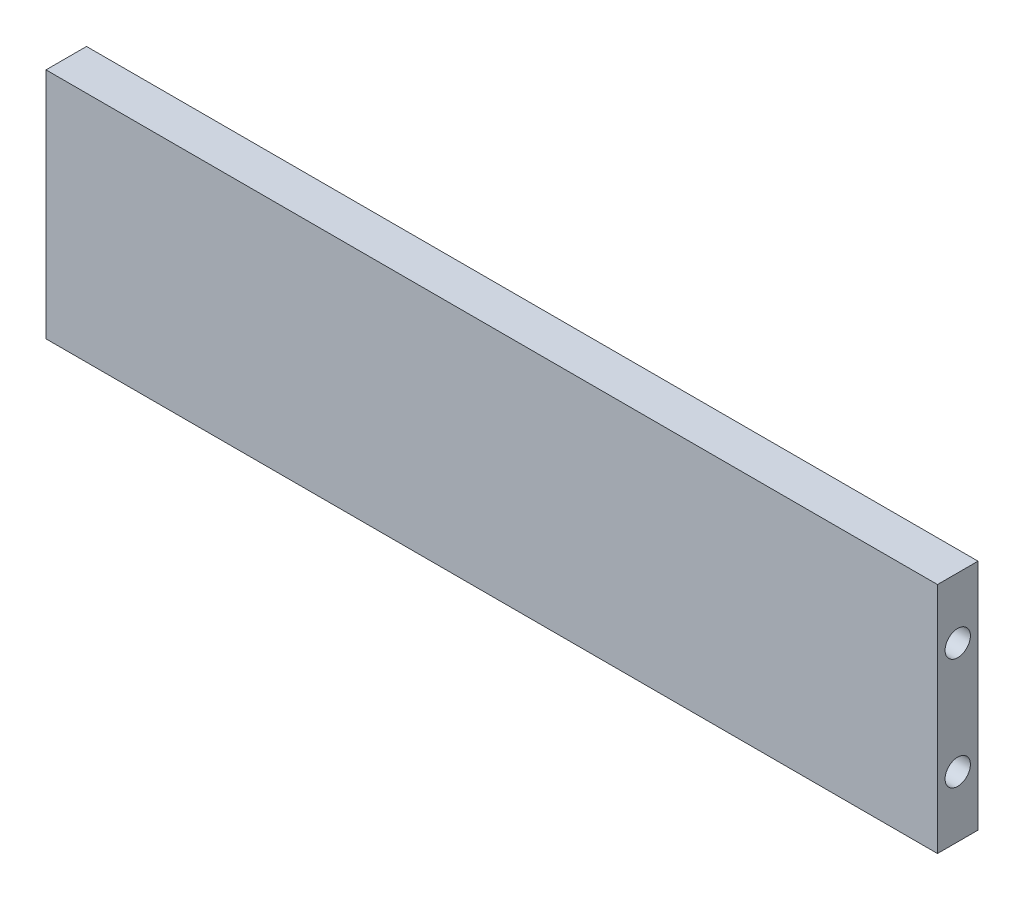
ISO-10303-21;
HEADER;
FILE_DESCRIPTION(('STEP AP214'),'2;1');
FILE_NAME('part.step','',(''),(''),'','','');
FILE_SCHEMA(('AUTOMOTIVE_DESIGN { 1 0 10303 214 1 1 1 1 }'));
ENDSEC;
DATA;
#1=APPLICATION_CONTEXT('core data for automotive mechanical design processes');
#2=APPLICATION_PROTOCOL_DEFINITION('international standard','automotive_design',2000,#1);
#3=PRODUCT_CONTEXT('',#1,'mechanical');
#4=PRODUCT('Part','Part','',(#3));
#5=PRODUCT_RELATED_PRODUCT_CATEGORY('part','',(#4));
#6=PRODUCT_DEFINITION_FORMATION('','',#4);
#7=PRODUCT_DEFINITION_CONTEXT('part definition',#1,'design');
#8=PRODUCT_DEFINITION('design','',#6,#7);
#9=PRODUCT_DEFINITION_SHAPE('','',#8);
#10=(LENGTH_UNIT() NAMED_UNIT(*) SI_UNIT(.MILLI.,.METRE.));
#11=(NAMED_UNIT(*) PLANE_ANGLE_UNIT() SI_UNIT($,.RADIAN.));
#12=(NAMED_UNIT(*) SI_UNIT($,.STERADIAN.) SOLID_ANGLE_UNIT());
#13=UNCERTAINTY_MEASURE_WITH_UNIT(LENGTH_MEASURE(1.E-05),#10,'distance_accuracy_value','');
#14=(GEOMETRIC_REPRESENTATION_CONTEXT(3) GLOBAL_UNCERTAINTY_ASSIGNED_CONTEXT((#13)) GLOBAL_UNIT_ASSIGNED_CONTEXT((#10,
#11,#12)) REPRESENTATION_CONTEXT('',''));
#15=CARTESIAN_POINT('',(0.,0.,0.));
#16=DIRECTION('',(0.,0.,1.));
#17=DIRECTION('',(1.,0.,0.));
#18=AXIS2_PLACEMENT_3D('',#15,#16,#17);
#19=CARTESIAN_POINT('',(0.,0.,4.));
#20=DIRECTION('',(1.,0.,0.));
#21=DIRECTION('',(0.,1.,0.));
#22=AXIS2_PLACEMENT_3D('',#19,#20,#21);
#23=PLANE('',#22);
#24=CARTESIAN_POINT('',(0.,-6.,2.));
#25=DIRECTION('',(-1.,0.,0.));
#26=DIRECTION('',(0.,-1.,0.));
#27=AXIS2_PLACEMENT_3D('',#24,#25,#26);
#28=CIRCLE('',#27,1.25);
#29=CARTESIAN_POINT('',(0.,-7.25,2.));
#30=VERTEX_POINT('',#29);
#31=EDGE_CURVE('E121',#30,#30,#28,.T.);
#32=ORIENTED_EDGE('',*,*,#31,.F.);
#33=EDGE_LOOP('',(#32));
#34=FACE_BOUND('',#33,.T.);
#35=CARTESIAN_POINT('',(0.,-17.,2.));
#36=DIRECTION('',(-1.,0.,0.));
#37=DIRECTION('',(0.,-1.,0.));
#38=AXIS2_PLACEMENT_3D('',#35,#36,#37);
#39=CIRCLE('',#38,1.25);
#40=CARTESIAN_POINT('',(0.,-18.25,2.));
#41=VERTEX_POINT('',#40);
#42=EDGE_CURVE('E114',#41,#41,#39,.T.);
#43=ORIENTED_EDGE('',*,*,#42,.F.);
#44=EDGE_LOOP('',(#43));
#45=FACE_BOUND('',#44,.T.);
#46=DIRECTION('',(0.,-1.,0.));
#47=VECTOR('',#46,1.);
#48=CARTESIAN_POINT('',(0.,0.,0.));
#49=LINE('',#48,#47);
#50=CARTESIAN_POINT('',(0.,0.,0.));
#51=VERTEX_POINT('',#50);
#52=CARTESIAN_POINT('',(0.,-23.,0.));
#53=VERTEX_POINT('',#52);
#54=EDGE_CURVE('E100',#51,#53,#49,.T.);
#55=ORIENTED_EDGE('',*,*,#54,.T.);
#56=DIRECTION('',(0.,0.,-1.));
#57=VECTOR('',#56,1.);
#58=CARTESIAN_POINT('',(0.,-23.,4.));
#59=LINE('',#58,#57);
#60=CARTESIAN_POINT('',(0.,-23.,4.));
#61=VERTEX_POINT('',#60);
#62=EDGE_CURVE('E11',#61,#53,#59,.T.);
#63=ORIENTED_EDGE('',*,*,#62,.F.);
#64=DIRECTION('',(0.,-1.,0.));
#65=VECTOR('',#64,1.);
#66=CARTESIAN_POINT('',(0.,0.,4.));
#67=LINE('',#66,#65);
#68=CARTESIAN_POINT('',(0.,0.,4.));
#69=VERTEX_POINT('',#68);
#70=EDGE_CURVE('E88',#69,#61,#67,.T.);
#71=ORIENTED_EDGE('',*,*,#70,.F.);
#72=DIRECTION('',(0.,0.,-1.));
#73=VECTOR('',#72,1.);
#74=CARTESIAN_POINT('',(0.,0.,4.));
#75=LINE('',#74,#73);
#76=EDGE_CURVE('E96',#69,#51,#75,.T.);
#77=ORIENTED_EDGE('',*,*,#76,.T.);
#78=EDGE_LOOP('',(#55,#63,#71,#77));
#79=FACE_BOUND('',#78,.T.);
#80=ADVANCED_FACE('F37',(#34,#45,#79),#23,.F.);
#81=CARTESIAN_POINT('',(0.,-23.,4.));
#82=DIRECTION('',(0.,1.,0.));
#83=DIRECTION('',(0.,0.,1.));
#84=AXIS2_PLACEMENT_3D('',#81,#82,#83);
#85=PLANE('',#84);
#86=DIRECTION('',(1.,0.,0.));
#87=VECTOR('',#86,1.);
#88=CARTESIAN_POINT('',(0.,-23.,0.));
#89=LINE('',#88,#87);
#90=CARTESIAN_POINT('',(88.01,-23.,0.));
#91=VERTEX_POINT('',#90);
#92=EDGE_CURVE('E92',#53,#91,#89,.T.);
#93=ORIENTED_EDGE('',*,*,#92,.T.);
#94=DIRECTION('',(0.,0.,-1.));
#95=VECTOR('',#94,1.);
#96=CARTESIAN_POINT('',(88.01,-23.,4.));
#97=LINE('',#96,#95);
#98=CARTESIAN_POINT('',(88.01,-23.,4.));
#99=VERTEX_POINT('',#98);
#100=EDGE_CURVE('E45',#99,#91,#97,.T.);
#101=ORIENTED_EDGE('',*,*,#100,.F.);
#102=DIRECTION('',(1.,0.,0.));
#103=VECTOR('',#102,1.);
#104=CARTESIAN_POINT('',(0.,-23.,4.));
#105=LINE('',#104,#103);
#106=EDGE_CURVE('E83',#61,#99,#105,.T.);
#107=ORIENTED_EDGE('',*,*,#106,.F.);
#108=ORIENTED_EDGE('',*,*,#62,.T.);
#109=EDGE_LOOP('',(#93,#101,#107,#108));
#110=FACE_BOUND('',#109,.T.);
#111=ADVANCED_FACE('F91',(#110),#85,.F.);
#112=CARTESIAN_POINT('',(88.01,0.,4.));
#113=DIRECTION('',(-1.,0.,0.));
#114=DIRECTION('',(0.,0.,1.));
#115=AXIS2_PLACEMENT_3D('',#112,#113,#114);
#116=PLANE('',#115);
#117=CARTESIAN_POINT('',(88.01,-6.,2.));
#118=DIRECTION('',(1.,0.,0.));
#119=DIRECTION('',(0.,0.,-1.));
#120=AXIS2_PLACEMENT_3D('',#117,#118,#119);
#121=CIRCLE('',#120,1.25);
#122=CARTESIAN_POINT('',(88.01,-6.,0.749999999999999));
#123=VERTEX_POINT('',#122);
#124=EDGE_CURVE('E132',#123,#123,#121,.T.);
#125=ORIENTED_EDGE('',*,*,#124,.F.);
#126=EDGE_LOOP('',(#125));
#127=FACE_BOUND('',#126,.T.);
#128=CARTESIAN_POINT('',(88.01,-17.,2.));
#129=DIRECTION('',(1.,0.,0.));
#130=DIRECTION('',(0.,0.,-1.));
#131=AXIS2_PLACEMENT_3D('',#128,#129,#130);
#132=CIRCLE('',#131,1.25);
#133=CARTESIAN_POINT('',(88.01,-17.,0.749999999999997));
#134=VERTEX_POINT('',#133);
#135=EDGE_CURVE('E126',#134,#134,#132,.T.);
#136=ORIENTED_EDGE('',*,*,#135,.F.);
#137=EDGE_LOOP('',(#136));
#138=FACE_BOUND('',#137,.T.);
#139=DIRECTION('',(0.,1.,0.));
#140=VECTOR('',#139,1.);
#141=CARTESIAN_POINT('',(88.01,0.,0.));
#142=LINE('',#141,#140);
#143=CARTESIAN_POINT('',(88.01,0.,0.));
#144=VERTEX_POINT('',#143);
#145=EDGE_CURVE('E70',#91,#144,#142,.T.);
#146=ORIENTED_EDGE('',*,*,#145,.T.);
#147=DIRECTION('',(0.,0.,-1.));
#148=VECTOR('',#147,1.);
#149=CARTESIAN_POINT('',(88.01,0.,4.));
#150=LINE('',#149,#148);
#151=CARTESIAN_POINT('',(88.01,0.,4.));
#152=VERTEX_POINT('',#151);
#153=EDGE_CURVE('E93',#152,#144,#150,.T.);
#154=ORIENTED_EDGE('',*,*,#153,.F.);
#155=DIRECTION('',(0.,1.,0.));
#156=VECTOR('',#155,1.);
#157=CARTESIAN_POINT('',(88.01,0.,4.));
#158=LINE('',#157,#156);
#159=EDGE_CURVE('E86',#99,#152,#158,.T.);
#160=ORIENTED_EDGE('',*,*,#159,.F.);
#161=ORIENTED_EDGE('',*,*,#100,.T.);
#162=EDGE_LOOP('',(#146,#154,#160,#161));
#163=FACE_BOUND('',#162,.T.);
#164=ADVANCED_FACE('F94',(#127,#138,#163),#116,.F.);
#165=CARTESIAN_POINT('',(0.,0.,4.));
#166=DIRECTION('',(0.,-1.,0.));
#167=DIRECTION('',(0.,0.,-1.));
#168=AXIS2_PLACEMENT_3D('',#165,#166,#167);
#169=PLANE('',#168);
#170=DIRECTION('',(-1.,0.,0.));
#171=VECTOR('',#170,1.);
#172=CARTESIAN_POINT('',(0.,0.,0.));
#173=LINE('',#172,#171);
#174=EDGE_CURVE('E76',#144,#51,#173,.T.);
#175=ORIENTED_EDGE('',*,*,#174,.T.);
#176=ORIENTED_EDGE('',*,*,#76,.F.);
#177=DIRECTION('',(-1.,0.,0.));
#178=VECTOR('',#177,1.);
#179=CARTESIAN_POINT('',(0.,0.,4.));
#180=LINE('',#179,#178);
#181=EDGE_CURVE('E53',#152,#69,#180,.T.);
#182=ORIENTED_EDGE('',*,*,#181,.F.);
#183=ORIENTED_EDGE('',*,*,#153,.T.);
#184=EDGE_LOOP('',(#175,#176,#182,#183));
#185=FACE_BOUND('',#184,.T.);
#186=ADVANCED_FACE('F108',(#185),#169,.F.);
#187=CARTESIAN_POINT('',(0.,0.,4.));
#188=DIRECTION('',(0.,0.,1.));
#189=DIRECTION('',(1.,0.,0.));
#190=AXIS2_PLACEMENT_3D('',#187,#188,#189);
#191=PLANE('',#190);
#192=ORIENTED_EDGE('',*,*,#70,.T.);
#193=ORIENTED_EDGE('',*,*,#106,.T.);
#194=ORIENTED_EDGE('',*,*,#159,.T.);
#195=ORIENTED_EDGE('',*,*,#181,.T.);
#196=EDGE_LOOP('',(#192,#193,#194,#195));
#197=FACE_BOUND('',#196,.T.);
#198=ADVANCED_FACE('F84',(#197),#191,.T.);
#199=CARTESIAN_POINT('',(0.,0.,0.));
#200=DIRECTION('',(0.,0.,1.));
#201=DIRECTION('',(1.,0.,0.));
#202=AXIS2_PLACEMENT_3D('',#199,#200,#201);
#203=PLANE('',#202);
#204=ORIENTED_EDGE('',*,*,#54,.F.);
#205=ORIENTED_EDGE('',*,*,#174,.F.);
#206=ORIENTED_EDGE('',*,*,#145,.F.);
#207=ORIENTED_EDGE('',*,*,#92,.F.);
#208=EDGE_LOOP('',(#204,#205,#206,#207));
#209=FACE_BOUND('',#208,.T.);
#210=ADVANCED_FACE('F111',(#209),#203,.F.);
#211=CARTESIAN_POINT('',(10.,-17.,2.));
#212=DIRECTION('',(-1.,0.,0.));
#213=DIRECTION('',(0.,-1.,0.));
#214=AXIS2_PLACEMENT_3D('',#211,#212,#213);
#215=CYLINDRICAL_SURFACE('',#214,1.25);
#216=CARTESIAN_POINT('',(10.,-17.,2.));
#217=DIRECTION('',(-1.,0.,0.));
#218=DIRECTION('',(0.,-1.,0.));
#219=AXIS2_PLACEMENT_3D('',#216,#217,#218);
#220=CIRCLE('',#219,1.25);
#221=CARTESIAN_POINT('',(10.,-18.25,2.));
#222=VERTEX_POINT('',#221);
#223=EDGE_CURVE('E117',#222,#222,#220,.T.);
#224=ORIENTED_EDGE('',*,*,#223,.F.);
#225=EDGE_LOOP('',(#224));
#226=FACE_BOUND('',#225,.T.);
#227=ORIENTED_EDGE('',*,*,#42,.T.);
#228=EDGE_LOOP('',(#227));
#229=FACE_BOUND('',#228,.T.);
#230=ADVANCED_FACE('F176',(#226,#229),#215,.F.);
#231=CARTESIAN_POINT('',(10.,-17.,2.));
#232=DIRECTION('',(-1.,0.,0.));
#233=DIRECTION('',(0.,-1.,0.));
#234=AXIS2_PLACEMENT_3D('',#231,#232,#233);
#235=PLANE('',#234);
#236=ORIENTED_EDGE('',*,*,#223,.T.);
#237=EDGE_LOOP('',(#236));
#238=FACE_BOUND('',#237,.T.);
#239=ADVANCED_FACE('F178',(#238),#235,.T.);
#240=CARTESIAN_POINT('',(10.,-6.,2.));
#241=DIRECTION('',(-1.,0.,0.));
#242=DIRECTION('',(0.,-1.,0.));
#243=AXIS2_PLACEMENT_3D('',#240,#241,#242);
#244=CYLINDRICAL_SURFACE('',#243,1.25);
#245=CARTESIAN_POINT('',(10.,-6.,2.));
#246=DIRECTION('',(-1.,0.,0.));
#247=DIRECTION('',(0.,-1.,0.));
#248=AXIS2_PLACEMENT_3D('',#245,#246,#247);
#249=CIRCLE('',#248,1.25);
#250=CARTESIAN_POINT('',(10.,-7.25,2.));
#251=VERTEX_POINT('',#250);
#252=EDGE_CURVE('E103',#251,#251,#249,.T.);
#253=ORIENTED_EDGE('',*,*,#252,.F.);
#254=EDGE_LOOP('',(#253));
#255=FACE_BOUND('',#254,.T.);
#256=ORIENTED_EDGE('',*,*,#31,.T.);
#257=EDGE_LOOP('',(#256));
#258=FACE_BOUND('',#257,.T.);
#259=ADVANCED_FACE('F163',(#255,#258),#244,.F.);
#260=CARTESIAN_POINT('',(10.,-6.,2.));
#261=DIRECTION('',(-1.,0.,0.));
#262=DIRECTION('',(0.,-1.,0.));
#263=AXIS2_PLACEMENT_3D('',#260,#261,#262);
#264=PLANE('',#263);
#265=ORIENTED_EDGE('',*,*,#252,.T.);
#266=EDGE_LOOP('',(#265));
#267=FACE_BOUND('',#266,.T.);
#268=ADVANCED_FACE('F154',(#267),#264,.T.);
#269=CARTESIAN_POINT('',(78.01,-17.,2.));
#270=DIRECTION('',(1.,0.,0.));
#271=DIRECTION('',(0.,0.,-1.));
#272=AXIS2_PLACEMENT_3D('',#269,#270,#271);
#273=CYLINDRICAL_SURFACE('',#272,1.25);
#274=CARTESIAN_POINT('',(78.01,-17.,2.));
#275=DIRECTION('',(1.,0.,0.));
#276=DIRECTION('',(0.,0.,-1.));
#277=AXIS2_PLACEMENT_3D('',#274,#275,#276);
#278=CIRCLE('',#277,1.25);
#279=CARTESIAN_POINT('',(78.01,-17.,0.749999999999997));
#280=VERTEX_POINT('',#279);
#281=EDGE_CURVE('E129',#280,#280,#278,.T.);
#282=ORIENTED_EDGE('',*,*,#281,.F.);
#283=EDGE_LOOP('',(#282));
#284=FACE_BOUND('',#283,.T.);
#285=ORIENTED_EDGE('',*,*,#135,.T.);
#286=EDGE_LOOP('',(#285));
#287=FACE_BOUND('',#286,.T.);
#288=ADVANCED_FACE('F152',(#284,#287),#273,.F.);
#289=CARTESIAN_POINT('',(78.01,-17.,2.));
#290=DIRECTION('',(1.,0.,0.));
#291=DIRECTION('',(0.,0.,-1.));
#292=AXIS2_PLACEMENT_3D('',#289,#290,#291);
#293=PLANE('',#292);
#294=ORIENTED_EDGE('',*,*,#281,.T.);
#295=EDGE_LOOP('',(#294));
#296=FACE_BOUND('',#295,.T.);
#297=ADVANCED_FACE('F143',(#296),#293,.T.);
#298=CARTESIAN_POINT('',(78.01,-6.,2.));
#299=DIRECTION('',(1.,0.,0.));
#300=DIRECTION('',(0.,0.,-1.));
#301=AXIS2_PLACEMENT_3D('',#298,#299,#300);
#302=CYLINDRICAL_SURFACE('',#301,1.25);
#303=CARTESIAN_POINT('',(78.01,-6.,2.));
#304=DIRECTION('',(1.,0.,0.));
#305=DIRECTION('',(0.,0.,-1.));
#306=AXIS2_PLACEMENT_3D('',#303,#304,#305);
#307=CIRCLE('',#306,1.25);
#308=CARTESIAN_POINT('',(78.01,-6.,0.749999999999999));
#309=VERTEX_POINT('',#308);
#310=EDGE_CURVE('E118',#309,#309,#307,.T.);
#311=ORIENTED_EDGE('',*,*,#310,.F.);
#312=EDGE_LOOP('',(#311));
#313=FACE_BOUND('',#312,.T.);
#314=ORIENTED_EDGE('',*,*,#124,.T.);
#315=EDGE_LOOP('',(#314));
#316=FACE_BOUND('',#315,.T.);
#317=ADVANCED_FACE('F140',(#313,#316),#302,.F.);
#318=CARTESIAN_POINT('',(78.01,-6.,2.));
#319=DIRECTION('',(1.,0.,0.));
#320=DIRECTION('',(0.,0.,-1.));
#321=AXIS2_PLACEMENT_3D('',#318,#319,#320);
#322=PLANE('',#321);
#323=ORIENTED_EDGE('',*,*,#310,.T.);
#324=EDGE_LOOP('',(#323));
#325=FACE_BOUND('',#324,.T.);
#326=ADVANCED_FACE('F138',(#325),#322,.T.);
#327=CLOSED_SHELL('',(#80,#111,#164,#186,#198,#210,#230,#239,#259,#268,#288,#297,#317,#326));
#328=MANIFOLD_SOLID_BREP('B2',#327);
#329=ADVANCED_BREP_SHAPE_REPRESENTATION('',(#18,#328),#14);
#330=SHAPE_DEFINITION_REPRESENTATION(#9,#329);
ENDSEC;
END-ISO-10303-21;
